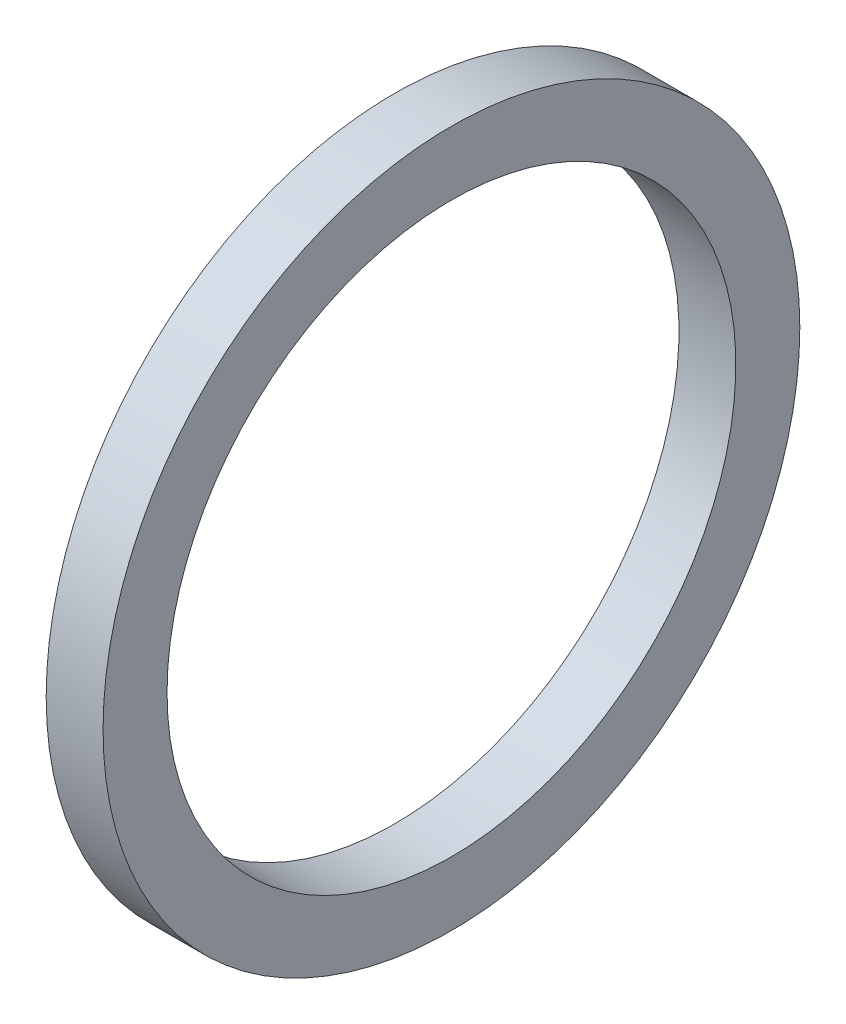
ISO-10303-21;
HEADER;
FILE_DESCRIPTION(('STEP AP214'),'2;1');
FILE_NAME('part.step','',(''),(''),'','','');
FILE_SCHEMA(('AUTOMOTIVE_DESIGN { 1 0 10303 214 1 1 1 1 }'));
ENDSEC;
DATA;
#1=APPLICATION_CONTEXT('core data for automotive mechanical design processes');
#2=APPLICATION_PROTOCOL_DEFINITION('international standard','automotive_design',2000,#1);
#3=PRODUCT_CONTEXT('',#1,'mechanical');
#4=PRODUCT('Part','Part','',(#3));
#5=PRODUCT_RELATED_PRODUCT_CATEGORY('part','',(#4));
#6=PRODUCT_DEFINITION_FORMATION('','',#4);
#7=PRODUCT_DEFINITION_CONTEXT('part definition',#1,'design');
#8=PRODUCT_DEFINITION('design','',#6,#7);
#9=PRODUCT_DEFINITION_SHAPE('','',#8);
#10=(LENGTH_UNIT() NAMED_UNIT(*) SI_UNIT(.MILLI.,.METRE.));
#11=(NAMED_UNIT(*) PLANE_ANGLE_UNIT() SI_UNIT($,.RADIAN.));
#12=(NAMED_UNIT(*) SI_UNIT($,.STERADIAN.) SOLID_ANGLE_UNIT());
#13=UNCERTAINTY_MEASURE_WITH_UNIT(LENGTH_MEASURE(1.E-05),#10,'distance_accuracy_value','');
#14=(GEOMETRIC_REPRESENTATION_CONTEXT(3) GLOBAL_UNCERTAINTY_ASSIGNED_CONTEXT((#13)) GLOBAL_UNIT_ASSIGNED_CONTEXT((#10,
#11,#12)) REPRESENTATION_CONTEXT('',''));
#15=CARTESIAN_POINT('',(0.,0.,0.));
#16=DIRECTION('',(0.,0.,1.));
#17=DIRECTION('',(1.,0.,0.));
#18=AXIS2_PLACEMENT_3D('',#15,#16,#17);
#19=CARTESIAN_POINT('',(0.,-10.16,0.));
#20=DIRECTION('',(-1.,0.,0.));
#21=DIRECTION('',(0.,0.,1.));
#22=AXIS2_PLACEMENT_3D('',#19,#20,#21);
#23=PLANE('',#22);
#24=CARTESIAN_POINT('',(0.,0.,0.));
#25=DIRECTION('',(-1.,0.,0.));
#26=DIRECTION('',(0.,0.,1.));
#27=AXIS2_PLACEMENT_3D('',#24,#25,#26);
#28=CIRCLE('',#27,12.446);
#29=CARTESIAN_POINT('',(0.,0.,12.446));
#30=VERTEX_POINT('',#29);
#31=EDGE_CURVE('E10',#30,#30,#28,.T.);
#32=ORIENTED_EDGE('',*,*,#31,.T.);
#33=EDGE_LOOP('',(#32));
#34=FACE_BOUND('',#33,.T.);
#35=CARTESIAN_POINT('',(0.,0.,0.));
#36=DIRECTION('',(-1.,0.,0.));
#37=DIRECTION('',(0.,0.,1.));
#38=AXIS2_PLACEMENT_3D('',#35,#36,#37);
#39=CIRCLE('',#38,10.16);
#40=CARTESIAN_POINT('',(0.,0.,10.16));
#41=VERTEX_POINT('',#40);
#42=EDGE_CURVE('E43',#41,#41,#39,.T.);
#43=ORIENTED_EDGE('',*,*,#42,.F.);
#44=EDGE_LOOP('',(#43));
#45=FACE_BOUND('',#44,.T.);
#46=ADVANCED_FACE('F29',(#34,#45),#23,.T.);
#47=CARTESIAN_POINT('',(-43.7165807560137,0.,0.));
#48=DIRECTION('',(-1.,0.,0.));
#49=DIRECTION('',(0.,0.,1.));
#50=AXIS2_PLACEMENT_3D('',#47,#48,#49);
#51=CYLINDRICAL_SURFACE('',#50,12.446);
#52=CARTESIAN_POINT('',(2.032,0.,0.));
#53=DIRECTION('',(-1.,0.,0.));
#54=DIRECTION('',(0.,0.,1.));
#55=AXIS2_PLACEMENT_3D('',#52,#53,#54);
#56=CIRCLE('',#55,12.446);
#57=CARTESIAN_POINT('',(2.032,0.,12.446));
#58=VERTEX_POINT('',#57);
#59=EDGE_CURVE('E35',#58,#58,#56,.T.);
#60=ORIENTED_EDGE('',*,*,#59,.T.);
#61=EDGE_LOOP('',(#60));
#62=FACE_BOUND('',#61,.T.);
#63=ORIENTED_EDGE('',*,*,#31,.F.);
#64=EDGE_LOOP('',(#63));
#65=FACE_BOUND('',#64,.T.);
#66=ADVANCED_FACE('F53',(#62,#65),#51,.T.);
#67=CARTESIAN_POINT('',(2.032,-10.16,0.));
#68=DIRECTION('',(1.,0.,0.));
#69=DIRECTION('',(0.,0.,-1.));
#70=AXIS2_PLACEMENT_3D('',#67,#68,#69);
#71=PLANE('',#70);
#72=CARTESIAN_POINT('',(2.032,0.,0.));
#73=DIRECTION('',(-1.,0.,0.));
#74=DIRECTION('',(0.,0.,1.));
#75=AXIS2_PLACEMENT_3D('',#72,#73,#74);
#76=CIRCLE('',#75,10.16);
#77=CARTESIAN_POINT('',(2.032,0.,10.16));
#78=VERTEX_POINT('',#77);
#79=EDGE_CURVE('E39',#78,#78,#76,.T.);
#80=ORIENTED_EDGE('',*,*,#79,.T.);
#81=EDGE_LOOP('',(#80));
#82=FACE_BOUND('',#81,.T.);
#83=ORIENTED_EDGE('',*,*,#59,.F.);
#84=EDGE_LOOP('',(#83));
#85=FACE_BOUND('',#84,.T.);
#86=ADVANCED_FACE('F57',(#82,#85),#71,.T.);
#87=CARTESIAN_POINT('',(-43.7165807560137,0.,0.));
#88=DIRECTION('',(-1.,0.,0.));
#89=DIRECTION('',(0.,0.,1.));
#90=AXIS2_PLACEMENT_3D('',#87,#88,#89);
#91=CYLINDRICAL_SURFACE('',#90,10.16);
#92=ORIENTED_EDGE('',*,*,#42,.T.);
#93=EDGE_LOOP('',(#92));
#94=FACE_BOUND('',#93,.T.);
#95=ORIENTED_EDGE('',*,*,#79,.F.);
#96=EDGE_LOOP('',(#95));
#97=FACE_BOUND('',#96,.T.);
#98=ADVANCED_FACE('F49',(#94,#97),#91,.F.);
#99=CLOSED_SHELL('',(#46,#66,#86,#98));
#100=MANIFOLD_SOLID_BREP('B2',#99);
#101=ADVANCED_BREP_SHAPE_REPRESENTATION('',(#18,#100),#14);
#102=SHAPE_DEFINITION_REPRESENTATION(#9,#101);
ENDSEC;
END-ISO-10303-21;
